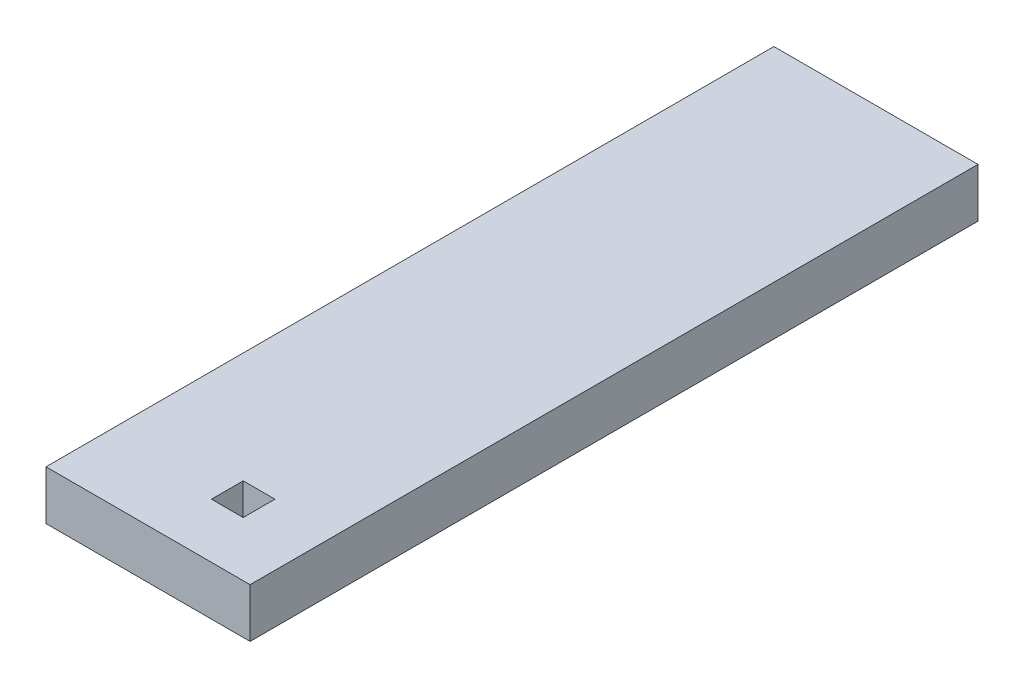
ISO-10303-21;
HEADER;
FILE_DESCRIPTION(('STEP AP214'),'2;1');
FILE_NAME('part.step','',(''),(''),'','','');
FILE_SCHEMA(('AUTOMOTIVE_DESIGN { 1 0 10303 214 1 1 1 1 }'));
ENDSEC;
DATA;
#1=APPLICATION_CONTEXT('core data for automotive mechanical design processes');
#2=APPLICATION_PROTOCOL_DEFINITION('international standard','automotive_design',2000,#1);
#3=PRODUCT_CONTEXT('',#1,'mechanical');
#4=PRODUCT('Part','Part','',(#3));
#5=PRODUCT_RELATED_PRODUCT_CATEGORY('part','',(#4));
#6=PRODUCT_DEFINITION_FORMATION('','',#4);
#7=PRODUCT_DEFINITION_CONTEXT('part definition',#1,'design');
#8=PRODUCT_DEFINITION('design','',#6,#7);
#9=PRODUCT_DEFINITION_SHAPE('','',#8);
#10=(LENGTH_UNIT() NAMED_UNIT(*) SI_UNIT(.MILLI.,.METRE.));
#11=(NAMED_UNIT(*) PLANE_ANGLE_UNIT() SI_UNIT($,.RADIAN.));
#12=(NAMED_UNIT(*) SI_UNIT($,.STERADIAN.) SOLID_ANGLE_UNIT());
#13=UNCERTAINTY_MEASURE_WITH_UNIT(LENGTH_MEASURE(1.E-05),#10,'distance_accuracy_value','');
#14=(GEOMETRIC_REPRESENTATION_CONTEXT(3) GLOBAL_UNCERTAINTY_ASSIGNED_CONTEXT((#13)) GLOBAL_UNIT_ASSIGNED_CONTEXT((#10,
#11,#12)) REPRESENTATION_CONTEXT('',''));
#15=CARTESIAN_POINT('',(0.,0.,0.));
#16=DIRECTION('',(0.,0.,1.));
#17=DIRECTION('',(1.,0.,0.));
#18=AXIS2_PLACEMENT_3D('',#15,#16,#17);
#19=CARTESIAN_POINT('',(0.,3.175,17.914243572));
#20=DIRECTION('',(0.,0.,-1.));
#21=DIRECTION('',(-1.,0.,0.));
#22=AXIS2_PLACEMENT_3D('',#19,#20,#21);
#23=PLANE('',#22);
#24=DIRECTION('',(1.,0.,0.));
#25=VECTOR('',#24,1.);
#26=CARTESIAN_POINT('',(0.,0.,17.914243572));
#27=LINE('',#26,#25);
#28=CARTESIAN_POINT('',(-1.024999982,0.,17.914243572));
#29=VERTEX_POINT('',#28);
#30=CARTESIAN_POINT('',(1.024999982,0.,17.914243572));
#31=VERTEX_POINT('',#30);
#32=EDGE_CURVE('E132',#29,#31,#27,.T.);
#33=ORIENTED_EDGE('',*,*,#32,.T.);
#34=DIRECTION('',(0.,-1.,0.));
#35=VECTOR('',#34,1.);
#36=CARTESIAN_POINT('',(1.024999982,3.175,17.914243572));
#37=LINE('',#36,#35);
#38=CARTESIAN_POINT('',(1.024999982,3.175,17.914243572));
#39=VERTEX_POINT('',#38);
#40=EDGE_CURVE('E11',#39,#31,#37,.T.);
#41=ORIENTED_EDGE('',*,*,#40,.F.);
#42=DIRECTION('',(1.,0.,0.));
#43=VECTOR('',#42,1.);
#44=CARTESIAN_POINT('',(0.,3.175,17.914243572));
#45=LINE('',#44,#43);
#46=CARTESIAN_POINT('',(-1.024999982,3.175,17.914243572));
#47=VERTEX_POINT('',#46);
#48=EDGE_CURVE('E106',#47,#39,#45,.T.);
#49=ORIENTED_EDGE('',*,*,#48,.F.);
#50=DIRECTION('',(0.,-1.,0.));
#51=VECTOR('',#50,1.);
#52=CARTESIAN_POINT('',(-1.024999982,3.175,17.914243572));
#53=LINE('',#52,#51);
#54=EDGE_CURVE('E55',#47,#29,#53,.T.);
#55=ORIENTED_EDGE('',*,*,#54,.T.);
#56=EDGE_LOOP('',(#33,#41,#49,#55));
#57=FACE_BOUND('',#56,.T.);
#58=ADVANCED_FACE('F36',(#57),#23,.F.);
#59=CARTESIAN_POINT('',(1.024999982,3.175,0.));
#60=DIRECTION('',(1.,0.,0.));
#61=DIRECTION('',(0.,0.,-1.));
#62=AXIS2_PLACEMENT_3D('',#59,#60,#61);
#63=PLANE('',#62);
#64=DIRECTION('',(0.,0.,1.));
#65=VECTOR('',#64,1.);
#66=CARTESIAN_POINT('',(1.024999982,0.,0.));
#67=LINE('',#66,#65);
#68=CARTESIAN_POINT('',(1.024999982,0.,19.964243536));
#69=VERTEX_POINT('',#68);
#70=EDGE_CURVE('E112',#31,#69,#67,.T.);
#71=ORIENTED_EDGE('',*,*,#70,.T.);
#72=DIRECTION('',(0.,-1.,0.));
#73=VECTOR('',#72,1.);
#74=CARTESIAN_POINT('',(1.024999982,3.175,19.964243536));
#75=LINE('',#74,#73);
#76=CARTESIAN_POINT('',(1.024999982,3.175,19.964243536));
#77=VERTEX_POINT('',#76);
#78=EDGE_CURVE('E46',#77,#69,#75,.T.);
#79=ORIENTED_EDGE('',*,*,#78,.F.);
#80=DIRECTION('',(0.,0.,1.));
#81=VECTOR('',#80,1.);
#82=CARTESIAN_POINT('',(1.024999982,3.175,0.));
#83=LINE('',#82,#81);
#84=EDGE_CURVE('E100',#39,#77,#83,.T.);
#85=ORIENTED_EDGE('',*,*,#84,.F.);
#86=ORIENTED_EDGE('',*,*,#40,.T.);
#87=EDGE_LOOP('',(#71,#79,#85,#86));
#88=FACE_BOUND('',#87,.T.);
#89=ADVANCED_FACE('F111',(#88),#63,.F.);
#90=CARTESIAN_POINT('',(0.,3.175,19.964243536));
#91=DIRECTION('',(0.,0.,-1.));
#92=DIRECTION('',(-1.,0.,0.));
#93=AXIS2_PLACEMENT_3D('',#90,#91,#92);
#94=PLANE('',#93);
#95=DIRECTION('',(1.,0.,0.));
#96=VECTOR('',#95,1.);
#97=CARTESIAN_POINT('',(0.,0.,19.964243536));
#98=LINE('',#97,#96);
#99=CARTESIAN_POINT('',(-1.024999982,0.,19.964243536));
#100=VERTEX_POINT('',#99);
#101=EDGE_CURVE('E135',#100,#69,#98,.T.);
#102=ORIENTED_EDGE('',*,*,#101,.F.);
#103=DIRECTION('',(0.,-1.,0.));
#104=VECTOR('',#103,1.);
#105=CARTESIAN_POINT('',(-1.024999982,3.175,19.964243536));
#106=LINE('',#105,#104);
#107=CARTESIAN_POINT('',(-1.024999982,3.175,19.964243536));
#108=VERTEX_POINT('',#107);
#109=EDGE_CURVE('E76',#108,#100,#106,.T.);
#110=ORIENTED_EDGE('',*,*,#109,.F.);
#111=DIRECTION('',(1.,0.,0.));
#112=VECTOR('',#111,1.);
#113=CARTESIAN_POINT('',(0.,3.175,19.964243536));
#114=LINE('',#113,#112);
#115=EDGE_CURVE('E105',#108,#77,#114,.T.);
#116=ORIENTED_EDGE('',*,*,#115,.T.);
#117=ORIENTED_EDGE('',*,*,#78,.T.);
#118=EDGE_LOOP('',(#102,#110,#116,#117));
#119=FACE_BOUND('',#118,.T.);
#120=ADVANCED_FACE('F116',(#119),#94,.T.);
#121=CARTESIAN_POINT('',(0.,3.175,23.495));
#122=DIRECTION('',(0.,0.,1.));
#123=DIRECTION('',(1.,0.,0.));
#124=AXIS2_PLACEMENT_3D('',#121,#122,#123);
#125=PLANE('',#124);
#126=DIRECTION('',(-1.,0.,0.));
#127=VECTOR('',#126,1.);
#128=CARTESIAN_POINT('',(0.,0.,23.495));
#129=LINE('',#128,#127);
#130=CARTESIAN_POINT('',(5.,0.,23.495));
#131=VERTEX_POINT('',#130);
#132=CARTESIAN_POINT('',(-8.175,0.,23.495));
#133=VERTEX_POINT('',#132);
#134=EDGE_CURVE('E123',#131,#133,#129,.T.);
#135=ORIENTED_EDGE('',*,*,#134,.F.);
#136=DIRECTION('',(0.,-1.,0.));
#137=VECTOR('',#136,1.);
#138=CARTESIAN_POINT('',(5.,3.175,23.495));
#139=LINE('',#138,#137);
#140=CARTESIAN_POINT('',(5.,3.175,23.495));
#141=VERTEX_POINT('',#140);
#142=EDGE_CURVE('E40',#141,#131,#139,.T.);
#143=ORIENTED_EDGE('',*,*,#142,.F.);
#144=DIRECTION('',(-1.,0.,0.));
#145=VECTOR('',#144,1.);
#146=CARTESIAN_POINT('',(0.,3.175,23.495));
#147=LINE('',#146,#145);
#148=CARTESIAN_POINT('',(-8.175,3.175,23.495));
#149=VERTEX_POINT('',#148);
#150=EDGE_CURVE('E140',#141,#149,#147,.T.);
#151=ORIENTED_EDGE('',*,*,#150,.T.);
#152=DIRECTION('',(0.,1.,0.));
#153=VECTOR('',#152,1.);
#154=CARTESIAN_POINT('',(-8.175,-47.0971413676032,23.495));
#155=LINE('',#154,#153);
#156=EDGE_CURVE('E159',#133,#149,#155,.T.);
#157=ORIENTED_EDGE('',*,*,#156,.F.);
#158=EDGE_LOOP('',(#135,#143,#151,#157));
#159=FACE_BOUND('',#158,.T.);
#160=ADVANCED_FACE('F38',(#159),#125,.T.);
#161=CARTESIAN_POINT('',(5.,3.175,0.));
#162=DIRECTION('',(-1.,0.,0.));
#163=DIRECTION('',(0.,0.,1.));
#164=AXIS2_PLACEMENT_3D('',#161,#162,#163);
#165=PLANE('',#164);
#166=DIRECTION('',(0.,0.,-1.));
#167=VECTOR('',#166,1.);
#168=CARTESIAN_POINT('',(5.,0.,0.));
#169=LINE('',#168,#167);
#170=CARTESIAN_POINT('',(5.,0.,-23.495));
#171=VERTEX_POINT('',#170);
#172=EDGE_CURVE('E126',#131,#171,#169,.T.);
#173=ORIENTED_EDGE('',*,*,#172,.T.);
#174=DIRECTION('',(0.,-1.,0.));
#175=VECTOR('',#174,1.);
#176=CARTESIAN_POINT('',(5.,3.175,-23.495));
#177=LINE('',#176,#175);
#178=CARTESIAN_POINT('',(5.,3.175,-23.495));
#179=VERTEX_POINT('',#178);
#180=EDGE_CURVE('E119',#179,#171,#177,.T.);
#181=ORIENTED_EDGE('',*,*,#180,.F.);
#182=DIRECTION('',(0.,0.,-1.));
#183=VECTOR('',#182,1.);
#184=CARTESIAN_POINT('',(5.,3.175,0.));
#185=LINE('',#184,#183);
#186=EDGE_CURVE('E150',#141,#179,#185,.T.);
#187=ORIENTED_EDGE('',*,*,#186,.F.);
#188=ORIENTED_EDGE('',*,*,#142,.T.);
#189=EDGE_LOOP('',(#173,#181,#187,#188));
#190=FACE_BOUND('',#189,.T.);
#191=ADVANCED_FACE('F149',(#190),#165,.F.);
#192=CARTESIAN_POINT('',(0.,3.175,-23.495));
#193=DIRECTION('',(0.,0.,1.));
#194=DIRECTION('',(1.,0.,0.));
#195=AXIS2_PLACEMENT_3D('',#192,#193,#194);
#196=PLANE('',#195);
#197=DIRECTION('',(-1.,0.,0.));
#198=VECTOR('',#197,1.);
#199=CARTESIAN_POINT('',(0.,0.,-23.495));
#200=LINE('',#199,#198);
#201=CARTESIAN_POINT('',(-8.175,0.,-23.495));
#202=VERTEX_POINT('',#201);
#203=EDGE_CURVE('E129',#171,#202,#200,.T.);
#204=ORIENTED_EDGE('',*,*,#203,.T.);
#205=DIRECTION('',(0.,1.,0.));
#206=VECTOR('',#205,1.);
#207=CARTESIAN_POINT('',(-8.175,-47.0971413676032,-23.495));
#208=LINE('',#207,#206);
#209=CARTESIAN_POINT('',(-8.175,3.175,-23.495));
#210=VERTEX_POINT('',#209);
#211=EDGE_CURVE('E165',#202,#210,#208,.T.);
#212=ORIENTED_EDGE('',*,*,#211,.T.);
#213=DIRECTION('',(-1.,0.,0.));
#214=VECTOR('',#213,1.);
#215=CARTESIAN_POINT('',(0.,3.175,-23.495));
#216=LINE('',#215,#214);
#217=EDGE_CURVE('E175',#179,#210,#216,.T.);
#218=ORIENTED_EDGE('',*,*,#217,.F.);
#219=ORIENTED_EDGE('',*,*,#180,.T.);
#220=EDGE_LOOP('',(#204,#212,#218,#219));
#221=FACE_BOUND('',#220,.T.);
#222=ADVANCED_FACE('F181',(#221),#196,.F.);
#223=CARTESIAN_POINT('',(-1.024999982,3.175,0.));
#224=DIRECTION('',(1.,0.,0.));
#225=DIRECTION('',(0.,0.,-1.));
#226=AXIS2_PLACEMENT_3D('',#223,#224,#225);
#227=PLANE('',#226);
#228=DIRECTION('',(0.,0.,1.));
#229=VECTOR('',#228,1.);
#230=CARTESIAN_POINT('',(-1.024999982,0.,0.));
#231=LINE('',#230,#229);
#232=EDGE_CURVE('E137',#29,#100,#231,.T.);
#233=ORIENTED_EDGE('',*,*,#232,.F.);
#234=ORIENTED_EDGE('',*,*,#54,.F.);
#235=DIRECTION('',(0.,0.,1.));
#236=VECTOR('',#235,1.);
#237=CARTESIAN_POINT('',(-1.024999982,3.175,0.));
#238=LINE('',#237,#236);
#239=EDGE_CURVE('E117',#47,#108,#238,.T.);
#240=ORIENTED_EDGE('',*,*,#239,.T.);
#241=ORIENTED_EDGE('',*,*,#109,.T.);
#242=EDGE_LOOP('',(#233,#234,#240,#241));
#243=FACE_BOUND('',#242,.T.);
#244=ADVANCED_FACE('F199',(#243),#227,.T.);
#245=CARTESIAN_POINT('',(0.,3.175,0.));
#246=DIRECTION('',(0.,1.,0.));
#247=DIRECTION('',(0.,0.,1.));
#248=AXIS2_PLACEMENT_3D('',#245,#246,#247);
#249=PLANE('',#248);
#250=ORIENTED_EDGE('',*,*,#217,.T.);
#251=DIRECTION('',(0.,0.,1.));
#252=VECTOR('',#251,1.);
#253=CARTESIAN_POINT('',(-8.175,3.175,-23.495));
#254=LINE('',#253,#252);
#255=EDGE_CURVE('E169',#210,#149,#254,.T.);
#256=ORIENTED_EDGE('',*,*,#255,.T.);
#257=ORIENTED_EDGE('',*,*,#150,.F.);
#258=ORIENTED_EDGE('',*,*,#186,.T.);
#259=EDGE_LOOP('',(#250,#256,#257,#258));
#260=FACE_BOUND('',#259,.T.);
#261=ORIENTED_EDGE('',*,*,#48,.T.);
#262=ORIENTED_EDGE('',*,*,#84,.T.);
#263=ORIENTED_EDGE('',*,*,#115,.F.);
#264=ORIENTED_EDGE('',*,*,#239,.F.);
#265=EDGE_LOOP('',(#261,#262,#263,#264));
#266=FACE_BOUND('',#265,.T.);
#267=ADVANCED_FACE('F102',(#260,#266),#249,.T.);
#268=CARTESIAN_POINT('',(0.,0.,0.));
#269=DIRECTION('',(0.,1.,0.));
#270=DIRECTION('',(0.,0.,1.));
#271=AXIS2_PLACEMENT_3D('',#268,#269,#270);
#272=PLANE('',#271);
#273=ORIENTED_EDGE('',*,*,#134,.T.);
#274=DIRECTION('',(0.,0.,-1.));
#275=VECTOR('',#274,1.);
#276=CARTESIAN_POINT('',(-8.175,0.,-23.495));
#277=LINE('',#276,#275);
#278=EDGE_CURVE('E127',#133,#202,#277,.T.);
#279=ORIENTED_EDGE('',*,*,#278,.T.);
#280=ORIENTED_EDGE('',*,*,#203,.F.);
#281=ORIENTED_EDGE('',*,*,#172,.F.);
#282=EDGE_LOOP('',(#273,#279,#280,#281));
#283=FACE_BOUND('',#282,.T.);
#284=ORIENTED_EDGE('',*,*,#32,.F.);
#285=ORIENTED_EDGE('',*,*,#232,.T.);
#286=ORIENTED_EDGE('',*,*,#101,.T.);
#287=ORIENTED_EDGE('',*,*,#70,.F.);
#288=EDGE_LOOP('',(#284,#285,#286,#287));
#289=FACE_BOUND('',#288,.T.);
#290=ADVANCED_FACE('F153',(#283,#289),#272,.F.);
#291=CARTESIAN_POINT('',(-8.175,-47.0971413676032,-23.495));
#292=DIRECTION('',(-1.,0.,0.));
#293=DIRECTION('',(0.,0.,1.));
#294=AXIS2_PLACEMENT_3D('',#291,#292,#293);
#295=PLANE('',#294);
#296=ORIENTED_EDGE('',*,*,#278,.F.);
#297=ORIENTED_EDGE('',*,*,#156,.T.);
#298=ORIENTED_EDGE('',*,*,#255,.F.);
#299=ORIENTED_EDGE('',*,*,#211,.F.);
#300=EDGE_LOOP('',(#296,#297,#298,#299));
#301=FACE_BOUND('',#300,.T.);
#302=ADVANCED_FACE('F182',(#301),#295,.T.);
#303=CLOSED_SHELL('',(#58,#89,#120,#160,#191,#222,#244,#267,#290,#302));
#304=MANIFOLD_SOLID_BREP('B2',#303);
#305=ADVANCED_BREP_SHAPE_REPRESENTATION('',(#18,#304),#14);
#306=SHAPE_DEFINITION_REPRESENTATION(#9,#305);
ENDSEC;
END-ISO-10303-21;
